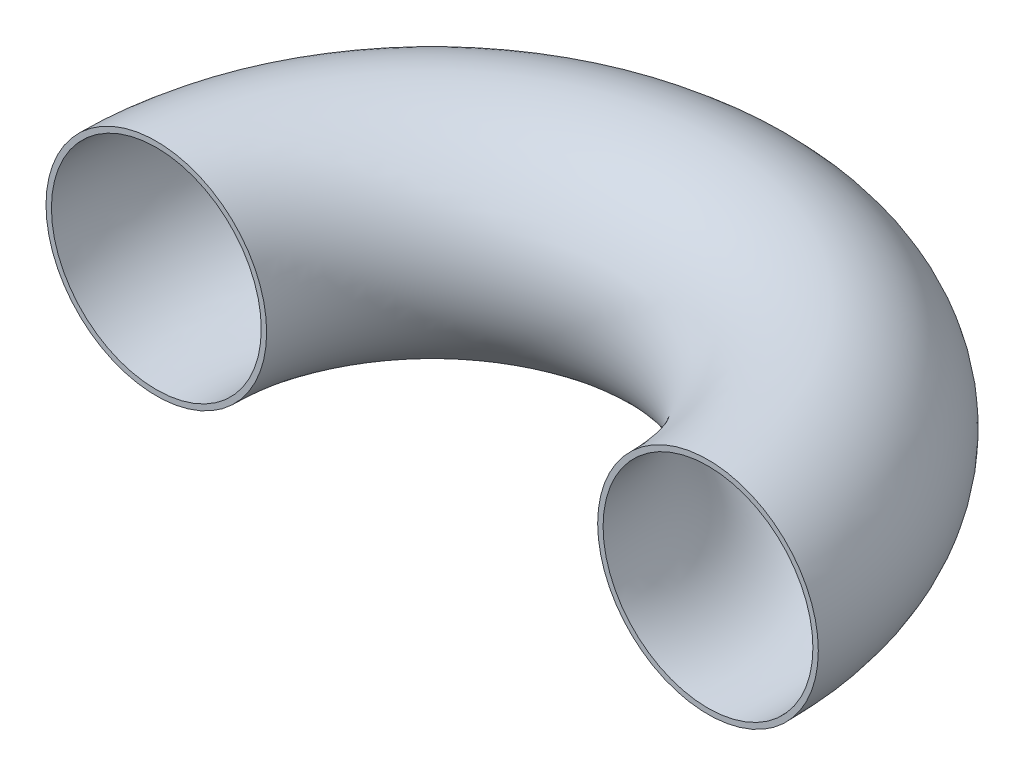
ISO-10303-21;
HEADER;
FILE_DESCRIPTION(('STEP AP214'),'2;1');
FILE_NAME('part.step','',(''),(''),'','','');
FILE_SCHEMA(('AUTOMOTIVE_DESIGN { 1 0 10303 214 1 1 1 1 }'));
ENDSEC;
DATA;
#1=APPLICATION_CONTEXT('core data for automotive mechanical design processes');
#2=APPLICATION_PROTOCOL_DEFINITION('international standard','automotive_design',2000,#1);
#3=PRODUCT_CONTEXT('',#1,'mechanical');
#4=PRODUCT('Part','Part','',(#3));
#5=PRODUCT_RELATED_PRODUCT_CATEGORY('part','',(#4));
#6=PRODUCT_DEFINITION_FORMATION('','',#4);
#7=PRODUCT_DEFINITION_CONTEXT('part definition',#1,'design');
#8=PRODUCT_DEFINITION('design','',#6,#7);
#9=PRODUCT_DEFINITION_SHAPE('','',#8);
#10=(LENGTH_UNIT() NAMED_UNIT(*) SI_UNIT(.MILLI.,.METRE.));
#11=(NAMED_UNIT(*) PLANE_ANGLE_UNIT() SI_UNIT($,.RADIAN.));
#12=(NAMED_UNIT(*) SI_UNIT($,.STERADIAN.) SOLID_ANGLE_UNIT());
#13=UNCERTAINTY_MEASURE_WITH_UNIT(LENGTH_MEASURE(1.E-05),#10,'distance_accuracy_value','');
#14=(GEOMETRIC_REPRESENTATION_CONTEXT(3) GLOBAL_UNCERTAINTY_ASSIGNED_CONTEXT((#13)) GLOBAL_UNIT_ASSIGNED_CONTEXT((#10,
#11,#12)) REPRESENTATION_CONTEXT('',''));
#15=CARTESIAN_POINT('',(0.,0.,0.));
#16=DIRECTION('',(0.,0.,1.));
#17=DIRECTION('',(1.,0.,0.));
#18=AXIS2_PLACEMENT_3D('',#15,#16,#17);
#19=CARTESIAN_POINT('',(63.5,0.,0.));
#20=DIRECTION('',(0.,1.,0.));
#21=DIRECTION('',(0.,0.,1.));
#22=AXIS2_PLACEMENT_3D('',#19,#20,#21);
#23=TOROIDAL_SURFACE('',#22,63.5,24.1554);
#24=CARTESIAN_POINT('',(127.,0.,8.94612767240741E-13));
#25=DIRECTION('',(0.,0.,-1.));
#26=DIRECTION('',(-1.,0.,0.));
#27=AXIS2_PLACEMENT_3D('',#24,#25,#26);
#28=CIRCLE('',#27,24.1554);
#29=CARTESIAN_POINT('',(151.1554,0.,1.23492346389912E-12));
#30=VERTEX_POINT('',#29);
#31=EDGE_CURVE('E40',#30,#30,#28,.T.);
#32=CARTESIAN_POINT('',(0.,0.,0.));
#33=DIRECTION('',(0.,0.,1.));
#34=DIRECTION('',(1.,0.,0.));
#35=AXIS2_PLACEMENT_3D('',#32,#33,#34);
#36=CIRCLE('',#35,24.1554);
#37=CARTESIAN_POINT('',(-24.1554,0.,0.));
#38=VERTEX_POINT('',#37);
#39=EDGE_CURVE('E48',#38,#38,#36,.T.);
#40=CARTESIAN_POINT('',(63.5,0.,0.));
#41=DIRECTION('',(0.,1.,0.));
#42=DIRECTION('',(0.,0.,1.));
#43=AXIS2_PLACEMENT_3D('',#40,#41,#42);
#44=CIRCLE('',#43,87.6554);
#45=EDGE_CURVE('',#30,#38,#44,.T.);
#46=ORIENTED_EDGE('',*,*,#31,.F.);
#47=ORIENTED_EDGE('',*,*,#39,.T.);
#48=ORIENTED_EDGE('',*,*,#45,.T.);
#49=ORIENTED_EDGE('',*,*,#45,.F.);
#50=EDGE_LOOP('',(#46,#48,#47,#49));
#51=FACE_BOUND('',#50,.T.);
#52=ADVANCED_FACE('F33',(#51),#23,.F.);
#53=CARTESIAN_POINT('',(63.5,0.,0.));
#54=DIRECTION('',(0.,1.,0.));
#55=DIRECTION('',(0.,0.,1.));
#56=AXIS2_PLACEMENT_3D('',#53,#54,#55);
#57=TOROIDAL_SURFACE('',#56,63.5,25.4);
#58=CARTESIAN_POINT('',(127.,0.,8.94612767240741E-13));
#59=DIRECTION('',(0.,0.,-1.));
#60=DIRECTION('',(-1.,0.,0.));
#61=AXIS2_PLACEMENT_3D('',#58,#59,#60);
#62=CIRCLE('',#61,25.4);
#63=CARTESIAN_POINT('',(152.4,0.,1.25245787413704E-12));
#64=VERTEX_POINT('',#63);
#65=EDGE_CURVE('E10',#64,#64,#62,.T.);
#66=CARTESIAN_POINT('',(0.,0.,0.));
#67=DIRECTION('',(0.,0.,1.));
#68=DIRECTION('',(1.,0.,0.));
#69=AXIS2_PLACEMENT_3D('',#66,#67,#68);
#70=CIRCLE('',#69,25.4);
#71=CARTESIAN_POINT('',(-25.4,0.,0.));
#72=VERTEX_POINT('',#71);
#73=EDGE_CURVE('E44',#72,#72,#70,.T.);
#74=CARTESIAN_POINT('',(63.5,0.,0.));
#75=DIRECTION('',(0.,1.,0.));
#76=DIRECTION('',(0.,0.,1.));
#77=AXIS2_PLACEMENT_3D('',#74,#75,#76);
#78=CIRCLE('',#77,88.9);
#79=EDGE_CURVE('',#64,#72,#78,.T.);
#80=ORIENTED_EDGE('',*,*,#65,.T.);
#81=ORIENTED_EDGE('',*,*,#73,.F.);
#82=ORIENTED_EDGE('',*,*,#79,.T.);
#83=ORIENTED_EDGE('',*,*,#79,.F.);
#84=EDGE_LOOP('',(#80,#82,#81,#83));
#85=FACE_BOUND('',#84,.T.);
#86=ADVANCED_FACE('F35',(#85),#57,.T.);
#87=CARTESIAN_POINT('',(127.,0.,8.94612767240741E-13));
#88=DIRECTION('',(0.,0.,-1.));
#89=DIRECTION('',(-1.,0.,0.));
#90=AXIS2_PLACEMENT_3D('',#87,#88,#89);
#91=PLANE('',#90);
#92=ORIENTED_EDGE('',*,*,#31,.T.);
#93=EDGE_LOOP('',(#92));
#94=FACE_BOUND('',#93,.T.);
#95=ORIENTED_EDGE('',*,*,#65,.F.);
#96=EDGE_LOOP('',(#95));
#97=FACE_BOUND('',#96,.T.);
#98=ADVANCED_FACE('F58',(#94,#97),#91,.F.);
#99=CARTESIAN_POINT('',(0.,0.,0.));
#100=DIRECTION('',(0.,0.,1.));
#101=DIRECTION('',(1.,0.,0.));
#102=AXIS2_PLACEMENT_3D('',#99,#100,#101);
#103=PLANE('',#102);
#104=ORIENTED_EDGE('',*,*,#39,.F.);
#105=EDGE_LOOP('',(#104));
#106=FACE_BOUND('',#105,.T.);
#107=ORIENTED_EDGE('',*,*,#73,.T.);
#108=EDGE_LOOP('',(#107));
#109=FACE_BOUND('',#108,.T.);
#110=ADVANCED_FACE('F55',(#106,#109),#103,.T.);
#111=CLOSED_SHELL('',(#52,#86,#98,#110));
#112=MANIFOLD_SOLID_BREP('B2',#111);
#113=ADVANCED_BREP_SHAPE_REPRESENTATION('',(#18,#112),#14);
#114=SHAPE_DEFINITION_REPRESENTATION(#9,#113);
ENDSEC;
END-ISO-10303-21;
